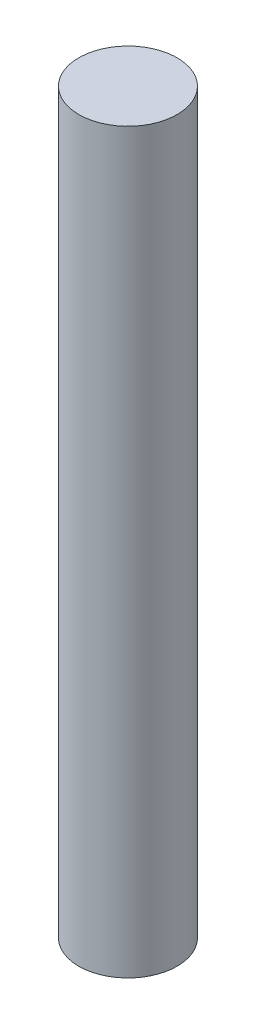
ISO-10303-21;
HEADER;
FILE_DESCRIPTION(('STEP AP214'),'2;1');
FILE_NAME('part.step','',(''),(''),'','','');
FILE_SCHEMA(('AUTOMOTIVE_DESIGN { 1 0 10303 214 1 1 1 1 }'));
ENDSEC;
DATA;
#1=APPLICATION_CONTEXT('core data for automotive mechanical design processes');
#2=APPLICATION_PROTOCOL_DEFINITION('international standard','automotive_design',2000,#1);
#3=PRODUCT_CONTEXT('',#1,'mechanical');
#4=PRODUCT('Part','Part','',(#3));
#5=PRODUCT_RELATED_PRODUCT_CATEGORY('part','',(#4));
#6=PRODUCT_DEFINITION_FORMATION('','',#4);
#7=PRODUCT_DEFINITION_CONTEXT('part definition',#1,'design');
#8=PRODUCT_DEFINITION('design','',#6,#7);
#9=PRODUCT_DEFINITION_SHAPE('','',#8);
#10=(LENGTH_UNIT() NAMED_UNIT(*) SI_UNIT(.MILLI.,.METRE.));
#11=(NAMED_UNIT(*) PLANE_ANGLE_UNIT() SI_UNIT($,.RADIAN.));
#12=(NAMED_UNIT(*) SI_UNIT($,.STERADIAN.) SOLID_ANGLE_UNIT());
#13=UNCERTAINTY_MEASURE_WITH_UNIT(LENGTH_MEASURE(1.E-05),#10,'distance_accuracy_value','');
#14=(GEOMETRIC_REPRESENTATION_CONTEXT(3) GLOBAL_UNCERTAINTY_ASSIGNED_CONTEXT((#13)) GLOBAL_UNIT_ASSIGNED_CONTEXT((#10,
#11,#12)) REPRESENTATION_CONTEXT('',''));
#15=CARTESIAN_POINT('',(0.,0.,0.));
#16=DIRECTION('',(0.,0.,1.));
#17=DIRECTION('',(1.,0.,0.));
#18=AXIS2_PLACEMENT_3D('',#15,#16,#17);
#19=CARTESIAN_POINT('',(0.,76.2,0.));
#20=DIRECTION('',(0.,-1.,0.));
#21=DIRECTION('',(0.,0.,-1.));
#22=AXIS2_PLACEMENT_3D('',#19,#20,#21);
#23=CYLINDRICAL_SURFACE('',#22,5.08);
#24=CARTESIAN_POINT('',(0.,76.2,0.));
#25=DIRECTION('',(0.,1.,0.));
#26=DIRECTION('',(0.,0.,1.));
#27=AXIS2_PLACEMENT_3D('',#24,#25,#26);
#28=CIRCLE('',#27,5.08);
#29=CARTESIAN_POINT('',(0.,76.2,5.08));
#30=VERTEX_POINT('',#29);
#31=EDGE_CURVE('E10',#30,#30,#28,.T.);
#32=ORIENTED_EDGE('',*,*,#31,.F.);
#33=EDGE_LOOP('',(#32));
#34=FACE_BOUND('',#33,.T.);
#35=CARTESIAN_POINT('',(0.,0.,0.));
#36=DIRECTION('',(0.,1.,0.));
#37=DIRECTION('',(0.,0.,1.));
#38=AXIS2_PLACEMENT_3D('',#35,#36,#37);
#39=CIRCLE('',#38,5.08);
#40=CARTESIAN_POINT('',(0.,0.,5.08));
#41=VERTEX_POINT('',#40);
#42=EDGE_CURVE('E33',#41,#41,#39,.T.);
#43=ORIENTED_EDGE('',*,*,#42,.T.);
#44=EDGE_LOOP('',(#43));
#45=FACE_BOUND('',#44,.T.);
#46=ADVANCED_FACE('F30',(#34,#45),#23,.T.);
#47=CARTESIAN_POINT('',(0.,76.2,0.));
#48=DIRECTION('',(0.,1.,0.));
#49=DIRECTION('',(0.,0.,1.));
#50=AXIS2_PLACEMENT_3D('',#47,#48,#49);
#51=PLANE('',#50);
#52=ORIENTED_EDGE('',*,*,#31,.T.);
#53=EDGE_LOOP('',(#52));
#54=FACE_BOUND('',#53,.T.);
#55=ADVANCED_FACE('F45',(#54),#51,.T.);
#56=CARTESIAN_POINT('',(0.,0.,0.));
#57=DIRECTION('',(0.,1.,0.));
#58=DIRECTION('',(0.,0.,1.));
#59=AXIS2_PLACEMENT_3D('',#56,#57,#58);
#60=PLANE('',#59);
#61=ORIENTED_EDGE('',*,*,#42,.F.);
#62=EDGE_LOOP('',(#61));
#63=FACE_BOUND('',#62,.T.);
#64=ADVANCED_FACE('F43',(#63),#60,.F.);
#65=CLOSED_SHELL('',(#46,#55,#64));
#66=MANIFOLD_SOLID_BREP('B2',#65);
#67=ADVANCED_BREP_SHAPE_REPRESENTATION('',(#18,#66),#14);
#68=SHAPE_DEFINITION_REPRESENTATION(#9,#67);
ENDSEC;
END-ISO-10303-21;
